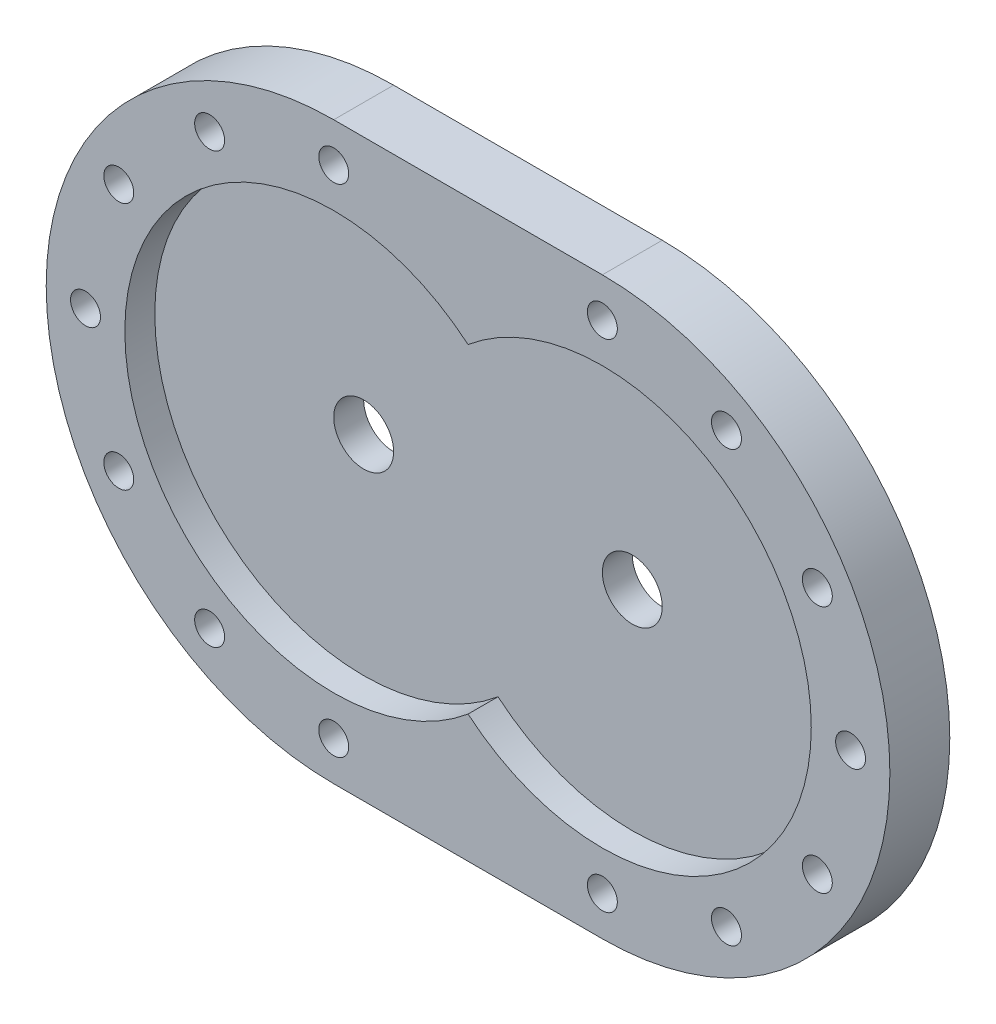
ISO-10303-21;
HEADER;
FILE_DESCRIPTION(('STEP AP214'),'2;1');
FILE_NAME('part.step','',(''),(''),'','','');
FILE_SCHEMA(('AUTOMOTIVE_DESIGN { 1 0 10303 214 1 1 1 1 }'));
ENDSEC;
DATA;
#1=APPLICATION_CONTEXT('core data for automotive mechanical design processes');
#2=APPLICATION_PROTOCOL_DEFINITION('international standard','automotive_design',2000,#1);
#3=PRODUCT_CONTEXT('',#1,'mechanical');
#4=PRODUCT('Part','Part','',(#3));
#5=PRODUCT_RELATED_PRODUCT_CATEGORY('part','',(#4));
#6=PRODUCT_DEFINITION_FORMATION('','',#4);
#7=PRODUCT_DEFINITION_CONTEXT('part definition',#1,'design');
#8=PRODUCT_DEFINITION('design','',#6,#7);
#9=PRODUCT_DEFINITION_SHAPE('','',#8);
#10=(LENGTH_UNIT() NAMED_UNIT(*) SI_UNIT(.MILLI.,.METRE.));
#11=(NAMED_UNIT(*) PLANE_ANGLE_UNIT() SI_UNIT($,.RADIAN.));
#12=(NAMED_UNIT(*) SI_UNIT($,.STERADIAN.) SOLID_ANGLE_UNIT());
#13=UNCERTAINTY_MEASURE_WITH_UNIT(LENGTH_MEASURE(1.E-05),#10,'distance_accuracy_value','');
#14=(GEOMETRIC_REPRESENTATION_CONTEXT(3) GLOBAL_UNCERTAINTY_ASSIGNED_CONTEXT((#13)) GLOBAL_UNIT_ASSIGNED_CONTEXT((#10,
#11,#12)) REPRESENTATION_CONTEXT('',''));
#15=CARTESIAN_POINT('',(0.,0.,0.));
#16=DIRECTION('',(0.,0.,1.));
#17=DIRECTION('',(1.,0.,0.));
#18=AXIS2_PLACEMENT_3D('',#15,#16,#17);
#19=CARTESIAN_POINT('',(-44.845,0.,20.));
#20=DIRECTION('',(0.,0.,-1.));
#21=DIRECTION('',(-1.,0.,0.));
#22=AXIS2_PLACEMENT_3D('',#19,#20,#21);
#23=CYLINDRICAL_SURFACE('',#22,96.);
#24=DIRECTION('',(0.,0.,-1.));
#25=VECTOR('',#24,1.);
#26=CARTESIAN_POINT('',(-44.844999999999,-96.,20.));
#27=LINE('',#26,#25);
#28=CARTESIAN_POINT('',(-44.845,-96.,20.));
#29=VERTEX_POINT('',#28);
#30=CARTESIAN_POINT('',(-44.845,-96.,0.));
#31=VERTEX_POINT('',#30);
#32=EDGE_CURVE('E63',#29,#31,#27,.T.);
#33=ORIENTED_EDGE('',*,*,#32,.F.);
#34=CARTESIAN_POINT('',(-44.845,0.,20.));
#35=DIRECTION('',(0.,0.,1.));
#36=DIRECTION('',(1.,0.,0.));
#37=AXIS2_PLACEMENT_3D('',#34,#35,#36);
#38=CIRCLE('',#37,96.);
#39=CARTESIAN_POINT('',(-44.8450000000003,96.,20.));
#40=VERTEX_POINT('',#39);
#41=EDGE_CURVE('E115',#40,#29,#38,.T.);
#42=ORIENTED_EDGE('',*,*,#41,.F.);
#43=DIRECTION('',(0.,0.,-1.));
#44=VECTOR('',#43,1.);
#45=CARTESIAN_POINT('',(-44.8450000000003,96.,20.));
#46=LINE('',#45,#44);
#47=CARTESIAN_POINT('',(-44.8450000000003,96.,0.));
#48=VERTEX_POINT('',#47);
#49=EDGE_CURVE('E114',#40,#48,#46,.T.);
#50=ORIENTED_EDGE('',*,*,#49,.T.);
#51=CARTESIAN_POINT('',(-44.845,0.,0.));
#52=DIRECTION('',(0.,0.,1.));
#53=DIRECTION('',(1.,0.,0.));
#54=AXIS2_PLACEMENT_3D('',#51,#52,#53);
#55=CIRCLE('',#54,96.);
#56=EDGE_CURVE('E100',#48,#31,#55,.T.);
#57=ORIENTED_EDGE('',*,*,#56,.T.);
#58=EDGE_LOOP('',(#33,#42,#50,#57));
#59=FACE_BOUND('',#58,.T.);
#60=ADVANCED_FACE('F47',(#59),#23,.T.);
#61=CARTESIAN_POINT('',(44.845,0.,20.));
#62=DIRECTION('',(0.,0.,-1.));
#63=DIRECTION('',(-1.,0.,0.));
#64=AXIS2_PLACEMENT_3D('',#61,#62,#63);
#65=CYLINDRICAL_SURFACE('',#64,96.);
#66=CARTESIAN_POINT('',(44.845,0.,20.));
#67=DIRECTION('',(0.,0.,1.));
#68=DIRECTION('',(1.,0.,0.));
#69=AXIS2_PLACEMENT_3D('',#66,#67,#68);
#70=CIRCLE('',#69,96.);
#71=CARTESIAN_POINT('',(44.845,-96.,20.));
#72=VERTEX_POINT('',#71);
#73=CARTESIAN_POINT('',(44.845,96.,20.));
#74=VERTEX_POINT('',#73);
#75=EDGE_CURVE('E71',#72,#74,#70,.T.);
#76=ORIENTED_EDGE('',*,*,#75,.F.);
#77=DIRECTION('',(0.,0.,-1.));
#78=VECTOR('',#77,1.);
#79=CARTESIAN_POINT('',(44.845000000001,-96.,20.));
#80=LINE('',#79,#78);
#81=CARTESIAN_POINT('',(44.845,-96.,0.));
#82=VERTEX_POINT('',#81);
#83=EDGE_CURVE('E130',#72,#82,#80,.T.);
#84=ORIENTED_EDGE('',*,*,#83,.T.);
#85=CARTESIAN_POINT('',(44.845,0.,0.));
#86=DIRECTION('',(0.,0.,1.));
#87=DIRECTION('',(1.,0.,0.));
#88=AXIS2_PLACEMENT_3D('',#85,#86,#87);
#89=CIRCLE('',#88,96.);
#90=CARTESIAN_POINT('',(44.845,96.,0.));
#91=VERTEX_POINT('',#90);
#92=EDGE_CURVE('E111',#82,#91,#89,.T.);
#93=ORIENTED_EDGE('',*,*,#92,.T.);
#94=DIRECTION('',(0.,0.,-1.));
#95=VECTOR('',#94,1.);
#96=CARTESIAN_POINT('',(44.8449999999997,96.,20.));
#97=LINE('',#96,#95);
#98=EDGE_CURVE('E120',#74,#91,#97,.T.);
#99=ORIENTED_EDGE('',*,*,#98,.F.);
#100=EDGE_LOOP('',(#76,#84,#93,#99));
#101=FACE_BOUND('',#100,.T.);
#102=ADVANCED_FACE('F341',(#101),#65,.T.);
#103=CARTESIAN_POINT('',(44.845,0.,20.));
#104=DIRECTION('',(0.,0.,-1.));
#105=DIRECTION('',(-1.,0.,0.));
#106=AXIS2_PLACEMENT_3D('',#103,#104,#105);
#107=CYLINDRICAL_SURFACE('',#106,69.75);
#108=CARTESIAN_POINT('',(44.845,0.,10.));
#109=DIRECTION('',(0.,0.,1.));
#110=DIRECTION('',(1.,0.,0.));
#111=AXIS2_PLACEMENT_3D('',#108,#109,#110);
#112=CIRCLE('',#111,69.75);
#113=CARTESIAN_POINT('',(0.,-53.4227336908175,10.));
#114=VERTEX_POINT('',#113);
#115=CARTESIAN_POINT('',(0.,53.4227336908174,10.));
#116=VERTEX_POINT('',#115);
#117=EDGE_CURVE('E149',#114,#116,#112,.T.);
#118=ORIENTED_EDGE('',*,*,#117,.F.);
#119=DIRECTION('',(0.,0.,-1.));
#120=VECTOR('',#119,1.);
#121=CARTESIAN_POINT('',(0.,-53.4227336908175,20.));
#122=LINE('',#121,#120);
#123=CARTESIAN_POINT('',(0.,-53.4227336908175,20.));
#124=VERTEX_POINT('',#123);
#125=EDGE_CURVE('E11',#124,#114,#122,.T.);
#126=ORIENTED_EDGE('',*,*,#125,.F.);
#127=CARTESIAN_POINT('',(44.845,0.,20.));
#128=DIRECTION('',(0.,0.,1.));
#129=DIRECTION('',(1.,0.,0.));
#130=AXIS2_PLACEMENT_3D('',#127,#128,#129);
#131=CIRCLE('',#130,69.75);
#132=CARTESIAN_POINT('',(0.,53.4227336908174,20.));
#133=VERTEX_POINT('',#132);
#134=EDGE_CURVE('E189',#124,#133,#131,.T.);
#135=ORIENTED_EDGE('',*,*,#134,.T.);
#136=DIRECTION('',(0.,0.,-1.));
#137=VECTOR('',#136,1.);
#138=CARTESIAN_POINT('',(0.,53.4227336908174,20.));
#139=LINE('',#138,#137);
#140=EDGE_CURVE('E56',#133,#116,#139,.T.);
#141=ORIENTED_EDGE('',*,*,#140,.T.);
#142=EDGE_LOOP('',(#118,#126,#135,#141));
#143=FACE_BOUND('',#142,.T.);
#144=ADVANCED_FACE('F287',(#143),#107,.F.);
#145=CARTESIAN_POINT('',(-116.616855338635,41.4375000000001,20.));
#146=DIRECTION('',(0.,0.,-1.));
#147=DIRECTION('',(-1.,0.,0.));
#148=AXIS2_PLACEMENT_3D('',#145,#146,#147);
#149=CYLINDRICAL_SURFACE('',#148,5.);
#150=CARTESIAN_POINT('',(-116.616855338635,41.4375000000001,20.));
#151=DIRECTION('',(0.,0.,1.));
#152=DIRECTION('',(1.,0.,0.));
#153=AXIS2_PLACEMENT_3D('',#150,#151,#152);
#154=CIRCLE('',#153,5.);
#155=CARTESIAN_POINT('',(-111.616855338635,41.4375000000001,20.));
#156=VERTEX_POINT('',#155);
#157=EDGE_CURVE('E221',#156,#156,#154,.F.);
#158=ORIENTED_EDGE('',*,*,#157,.F.);
#159=EDGE_LOOP('',(#158));
#160=FACE_BOUND('',#159,.T.);
#161=CARTESIAN_POINT('',(-116.616855338635,41.4375000000001,0.));
#162=DIRECTION('',(0.,0.,1.));
#163=DIRECTION('',(1.,0.,0.));
#164=AXIS2_PLACEMENT_3D('',#161,#162,#163);
#165=CIRCLE('',#164,5.);
#166=CARTESIAN_POINT('',(-111.616855338635,41.4375000000001,0.));
#167=VERTEX_POINT('',#166);
#168=EDGE_CURVE('E277',#167,#167,#165,.F.);
#169=ORIENTED_EDGE('',*,*,#168,.T.);
#170=EDGE_LOOP('',(#169));
#171=FACE_BOUND('',#170,.T.);
#172=ADVANCED_FACE('F399',(#160,#171),#149,.F.);
#173=CARTESIAN_POINT('',(116.616855338635,-41.4375000000001,20.));
#174=DIRECTION('',(0.,0.,-1.));
#175=DIRECTION('',(-1.,0.,0.));
#176=AXIS2_PLACEMENT_3D('',#173,#174,#175);
#177=CYLINDRICAL_SURFACE('',#176,5.);
#178=CARTESIAN_POINT('',(116.616855338635,-41.4375000000001,20.));
#179=DIRECTION('',(0.,0.,1.));
#180=DIRECTION('',(1.,0.,0.));
#181=AXIS2_PLACEMENT_3D('',#178,#179,#180);
#182=CIRCLE('',#181,5.);
#183=CARTESIAN_POINT('',(121.616855338635,-41.4375000000001,20.));
#184=VERTEX_POINT('',#183);
#185=EDGE_CURVE('E217',#184,#184,#182,.F.);
#186=ORIENTED_EDGE('',*,*,#185,.F.);
#187=EDGE_LOOP('',(#186));
#188=FACE_BOUND('',#187,.T.);
#189=CARTESIAN_POINT('',(116.616855338635,-41.4375000000001,0.));
#190=DIRECTION('',(0.,0.,1.));
#191=DIRECTION('',(1.,0.,0.));
#192=AXIS2_PLACEMENT_3D('',#189,#190,#191);
#193=CIRCLE('',#192,5.);
#194=CARTESIAN_POINT('',(121.616855338635,-41.4375000000001,0.));
#195=VERTEX_POINT('',#194);
#196=EDGE_CURVE('E273',#195,#195,#193,.F.);
#197=ORIENTED_EDGE('',*,*,#196,.T.);
#198=EDGE_LOOP('',(#197));
#199=FACE_BOUND('',#198,.T.);
#200=ADVANCED_FACE('F401',(#188,#199),#177,.F.);
#201=CARTESIAN_POINT('',(44.8449999999997,-82.875,20.));
#202=DIRECTION('',(0.,0.,-1.));
#203=DIRECTION('',(-1.,0.,0.));
#204=AXIS2_PLACEMENT_3D('',#201,#202,#203);
#205=CYLINDRICAL_SURFACE('',#204,5.);
#206=CARTESIAN_POINT('',(44.8449999999997,-82.875,20.));
#207=DIRECTION('',(0.,0.,1.));
#208=DIRECTION('',(1.,0.,0.));
#209=AXIS2_PLACEMENT_3D('',#206,#207,#208);
#210=CIRCLE('',#209,5.);
#211=CARTESIAN_POINT('',(49.8449999999997,-82.875,20.));
#212=VERTEX_POINT('',#211);
#213=EDGE_CURVE('E213',#212,#212,#210,.F.);
#214=ORIENTED_EDGE('',*,*,#213,.F.);
#215=EDGE_LOOP('',(#214));
#216=FACE_BOUND('',#215,.T.);
#217=CARTESIAN_POINT('',(44.8449999999997,-82.875,0.));
#218=DIRECTION('',(0.,0.,1.));
#219=DIRECTION('',(1.,0.,0.));
#220=AXIS2_PLACEMENT_3D('',#217,#218,#219);
#221=CIRCLE('',#220,5.);
#222=CARTESIAN_POINT('',(49.8449999999997,-82.875,0.));
#223=VERTEX_POINT('',#222);
#224=EDGE_CURVE('E269',#223,#223,#221,.F.);
#225=ORIENTED_EDGE('',*,*,#224,.T.);
#226=EDGE_LOOP('',(#225));
#227=FACE_BOUND('',#226,.T.);
#228=ADVANCED_FACE('F408',(#216,#227),#205,.F.);
#229=CARTESIAN_POINT('',(44.8449999999997,82.875,20.));
#230=DIRECTION('',(0.,0.,-1.));
#231=DIRECTION('',(-1.,0.,0.));
#232=AXIS2_PLACEMENT_3D('',#229,#230,#231);
#233=CYLINDRICAL_SURFACE('',#232,5.);
#234=CARTESIAN_POINT('',(44.8449999999997,82.875,20.));
#235=DIRECTION('',(0.,0.,1.));
#236=DIRECTION('',(1.,0.,0.));
#237=AXIS2_PLACEMENT_3D('',#234,#235,#236);
#238=CIRCLE('',#237,5.);
#239=CARTESIAN_POINT('',(49.8449999999997,82.875,20.));
#240=VERTEX_POINT('',#239);
#241=EDGE_CURVE('E209',#240,#240,#238,.T.);
#242=ORIENTED_EDGE('',*,*,#241,.T.);
#243=EDGE_LOOP('',(#242));
#244=FACE_BOUND('',#243,.T.);
#245=CARTESIAN_POINT('',(44.8449999999997,82.875,0.));
#246=DIRECTION('',(0.,0.,1.));
#247=DIRECTION('',(1.,0.,0.));
#248=AXIS2_PLACEMENT_3D('',#245,#246,#247);
#249=CIRCLE('',#248,5.);
#250=CARTESIAN_POINT('',(49.8449999999997,82.875,0.));
#251=VERTEX_POINT('',#250);
#252=EDGE_CURVE('E265',#251,#251,#249,.T.);
#253=ORIENTED_EDGE('',*,*,#252,.F.);
#254=EDGE_LOOP('',(#253));
#255=FACE_BOUND('',#254,.T.);
#256=ADVANCED_FACE('F414',(#244,#255),#233,.F.);
#257=CARTESIAN_POINT('',(86.2824999999998,71.7718553386354,20.));
#258=DIRECTION('',(0.,0.,-1.));
#259=DIRECTION('',(-1.,0.,0.));
#260=AXIS2_PLACEMENT_3D('',#257,#258,#259);
#261=CYLINDRICAL_SURFACE('',#260,5.00000000000001);
#262=CARTESIAN_POINT('',(86.2824999999998,71.7718553386354,20.));
#263=DIRECTION('',(0.,0.,1.));
#264=DIRECTION('',(1.,0.,0.));
#265=AXIS2_PLACEMENT_3D('',#262,#263,#264);
#266=CIRCLE('',#265,5.00000000000001);
#267=CARTESIAN_POINT('',(91.2824999999999,71.7718553386354,20.));
#268=VERTEX_POINT('',#267);
#269=EDGE_CURVE('E205',#268,#268,#266,.T.);
#270=ORIENTED_EDGE('',*,*,#269,.T.);
#271=EDGE_LOOP('',(#270));
#272=FACE_BOUND('',#271,.T.);
#273=CARTESIAN_POINT('',(86.2824999999998,71.7718553386354,0.));
#274=DIRECTION('',(0.,0.,1.));
#275=DIRECTION('',(1.,0.,0.));
#276=AXIS2_PLACEMENT_3D('',#273,#274,#275);
#277=CIRCLE('',#276,5.00000000000001);
#278=CARTESIAN_POINT('',(91.2824999999999,71.7718553386354,0.));
#279=VERTEX_POINT('',#278);
#280=EDGE_CURVE('E261',#279,#279,#277,.T.);
#281=ORIENTED_EDGE('',*,*,#280,.F.);
#282=EDGE_LOOP('',(#281));
#283=FACE_BOUND('',#282,.T.);
#284=ADVANCED_FACE('F418',(#272,#283),#261,.F.);
#285=CARTESIAN_POINT('',(116.616855338635,41.4375000000001,20.));
#286=DIRECTION('',(0.,0.,-1.));
#287=DIRECTION('',(-1.,0.,0.));
#288=AXIS2_PLACEMENT_3D('',#285,#286,#287);
#289=CYLINDRICAL_SURFACE('',#288,5.);
#290=CARTESIAN_POINT('',(116.616855338635,41.4375000000001,20.));
#291=DIRECTION('',(0.,0.,1.));
#292=DIRECTION('',(1.,0.,0.));
#293=AXIS2_PLACEMENT_3D('',#290,#291,#292);
#294=CIRCLE('',#293,5.);
#295=CARTESIAN_POINT('',(121.616855338635,41.4375000000001,20.));
#296=VERTEX_POINT('',#295);
#297=EDGE_CURVE('E201',#296,#296,#294,.T.);
#298=ORIENTED_EDGE('',*,*,#297,.T.);
#299=EDGE_LOOP('',(#298));
#300=FACE_BOUND('',#299,.T.);
#301=CARTESIAN_POINT('',(116.616855338635,41.4375000000001,0.));
#302=DIRECTION('',(0.,0.,1.));
#303=DIRECTION('',(1.,0.,0.));
#304=AXIS2_PLACEMENT_3D('',#301,#302,#303);
#305=CIRCLE('',#304,5.);
#306=CARTESIAN_POINT('',(121.616855338635,41.4375000000001,0.));
#307=VERTEX_POINT('',#306);
#308=EDGE_CURVE('E257',#307,#307,#305,.T.);
#309=ORIENTED_EDGE('',*,*,#308,.F.);
#310=EDGE_LOOP('',(#309));
#311=FACE_BOUND('',#310,.T.);
#312=ADVANCED_FACE('F422',(#300,#311),#289,.F.);
#313=CARTESIAN_POINT('',(127.72,0.,20.));
#314=DIRECTION('',(0.,0.,-1.));
#315=DIRECTION('',(-1.,0.,0.));
#316=AXIS2_PLACEMENT_3D('',#313,#314,#315);
#317=CYLINDRICAL_SURFACE('',#316,4.99999999999999);
#318=CARTESIAN_POINT('',(127.72,0.,20.));
#319=DIRECTION('',(0.,0.,1.));
#320=DIRECTION('',(1.,0.,0.));
#321=AXIS2_PLACEMENT_3D('',#318,#319,#320);
#322=CIRCLE('',#321,4.99999999999999);
#323=CARTESIAN_POINT('',(132.72,0.,20.));
#324=VERTEX_POINT('',#323);
#325=EDGE_CURVE('E197',#324,#324,#322,.T.);
#326=ORIENTED_EDGE('',*,*,#325,.T.);
#327=EDGE_LOOP('',(#326));
#328=FACE_BOUND('',#327,.T.);
#329=CARTESIAN_POINT('',(127.72,0.,0.));
#330=DIRECTION('',(0.,0.,1.));
#331=DIRECTION('',(1.,0.,0.));
#332=AXIS2_PLACEMENT_3D('',#329,#330,#331);
#333=CIRCLE('',#332,4.99999999999999);
#334=CARTESIAN_POINT('',(132.72,0.,0.));
#335=VERTEX_POINT('',#334);
#336=EDGE_CURVE('E110',#335,#335,#333,.T.);
#337=ORIENTED_EDGE('',*,*,#336,.F.);
#338=EDGE_LOOP('',(#337));
#339=FACE_BOUND('',#338,.T.);
#340=ADVANCED_FACE('F426',(#328,#339),#317,.F.);
#341=CARTESIAN_POINT('',(-44.845,0.,20.));
#342=DIRECTION('',(0.,0.,-1.));
#343=DIRECTION('',(-1.,0.,0.));
#344=AXIS2_PLACEMENT_3D('',#341,#342,#343);
#345=CYLINDRICAL_SURFACE('',#344,69.75);
#346=CARTESIAN_POINT('',(-44.845,0.,10.));
#347=DIRECTION('',(0.,0.,1.));
#348=DIRECTION('',(1.,0.,0.));
#349=AXIS2_PLACEMENT_3D('',#346,#347,#348);
#350=CIRCLE('',#349,69.75);
#351=EDGE_CURVE('E145',#116,#114,#350,.T.);
#352=ORIENTED_EDGE('',*,*,#351,.F.);
#353=ORIENTED_EDGE('',*,*,#140,.F.);
#354=CARTESIAN_POINT('',(-44.845,0.,20.));
#355=DIRECTION('',(0.,0.,1.));
#356=DIRECTION('',(1.,0.,0.));
#357=AXIS2_PLACEMENT_3D('',#354,#355,#356);
#358=CIRCLE('',#357,69.75);
#359=EDGE_CURVE('E193',#133,#124,#358,.T.);
#360=ORIENTED_EDGE('',*,*,#359,.T.);
#361=ORIENTED_EDGE('',*,*,#125,.T.);
#362=EDGE_LOOP('',(#352,#353,#360,#361));
#363=FACE_BOUND('',#362,.T.);
#364=ADVANCED_FACE('F293',(#363),#345,.F.);
#365=CARTESIAN_POINT('',(86.2824999999998,-71.7718553386354,20.));
#366=DIRECTION('',(0.,0.,-1.));
#367=DIRECTION('',(-1.,0.,0.));
#368=AXIS2_PLACEMENT_3D('',#365,#366,#367);
#369=CYLINDRICAL_SURFACE('',#368,5.00000000000001);
#370=CARTESIAN_POINT('',(86.2824999999998,-71.7718553386354,20.));
#371=DIRECTION('',(0.,0.,1.));
#372=DIRECTION('',(1.,0.,0.));
#373=AXIS2_PLACEMENT_3D('',#370,#371,#372);
#374=CIRCLE('',#373,5.00000000000001);
#375=CARTESIAN_POINT('',(91.2824999999999,-71.7718553386354,20.));
#376=VERTEX_POINT('',#375);
#377=EDGE_CURVE('E181',#376,#376,#374,.F.);
#378=ORIENTED_EDGE('',*,*,#377,.F.);
#379=EDGE_LOOP('',(#378));
#380=FACE_BOUND('',#379,.T.);
#381=CARTESIAN_POINT('',(86.2824999999998,-71.7718553386354,0.));
#382=DIRECTION('',(0.,0.,1.));
#383=DIRECTION('',(1.,0.,0.));
#384=AXIS2_PLACEMENT_3D('',#381,#382,#383);
#385=CIRCLE('',#384,5.00000000000001);
#386=CARTESIAN_POINT('',(91.2824999999999,-71.7718553386354,0.));
#387=VERTEX_POINT('',#386);
#388=EDGE_CURVE('E248',#387,#387,#385,.F.);
#389=ORIENTED_EDGE('',*,*,#388,.T.);
#390=EDGE_LOOP('',(#389));
#391=FACE_BOUND('',#390,.T.);
#392=ADVANCED_FACE('F350',(#380,#391),#369,.F.);
#393=CARTESIAN_POINT('',(-44.8449999999997,-82.875,20.));
#394=DIRECTION('',(0.,0.,-1.));
#395=DIRECTION('',(-1.,0.,0.));
#396=AXIS2_PLACEMENT_3D('',#393,#394,#395);
#397=CYLINDRICAL_SURFACE('',#396,5.);
#398=CARTESIAN_POINT('',(-44.8449999999997,-82.875,20.));
#399=DIRECTION('',(0.,0.,1.));
#400=DIRECTION('',(1.,0.,0.));
#401=AXIS2_PLACEMENT_3D('',#398,#399,#400);
#402=CIRCLE('',#401,5.);
#403=CARTESIAN_POINT('',(-39.8449999999997,-82.875,20.));
#404=VERTEX_POINT('',#403);
#405=EDGE_CURVE('E177',#404,#404,#402,.T.);
#406=ORIENTED_EDGE('',*,*,#405,.T.);
#407=EDGE_LOOP('',(#406));
#408=FACE_BOUND('',#407,.T.);
#409=CARTESIAN_POINT('',(-44.8449999999997,-82.875,0.));
#410=DIRECTION('',(0.,0.,1.));
#411=DIRECTION('',(1.,0.,0.));
#412=AXIS2_PLACEMENT_3D('',#409,#410,#411);
#413=CIRCLE('',#412,5.);
#414=CARTESIAN_POINT('',(-39.8449999999997,-82.875,0.));
#415=VERTEX_POINT('',#414);
#416=EDGE_CURVE('E244',#415,#415,#413,.T.);
#417=ORIENTED_EDGE('',*,*,#416,.F.);
#418=EDGE_LOOP('',(#417));
#419=FACE_BOUND('',#418,.T.);
#420=ADVANCED_FACE('F353',(#408,#419),#397,.F.);
#421=CARTESIAN_POINT('',(-86.2824999999998,-71.7718553386354,20.));
#422=DIRECTION('',(0.,0.,-1.));
#423=DIRECTION('',(-1.,0.,0.));
#424=AXIS2_PLACEMENT_3D('',#421,#422,#423);
#425=CYLINDRICAL_SURFACE('',#424,5.00000000000001);
#426=CARTESIAN_POINT('',(-86.2824999999998,-71.7718553386354,20.));
#427=DIRECTION('',(0.,0.,1.));
#428=DIRECTION('',(1.,0.,0.));
#429=AXIS2_PLACEMENT_3D('',#426,#427,#428);
#430=CIRCLE('',#429,5.00000000000001);
#431=CARTESIAN_POINT('',(-81.2824999999998,-71.7718553386354,20.));
#432=VERTEX_POINT('',#431);
#433=EDGE_CURVE('E173',#432,#432,#430,.T.);
#434=ORIENTED_EDGE('',*,*,#433,.T.);
#435=EDGE_LOOP('',(#434));
#436=FACE_BOUND('',#435,.T.);
#437=CARTESIAN_POINT('',(-86.2824999999998,-71.7718553386354,0.));
#438=DIRECTION('',(0.,0.,1.));
#439=DIRECTION('',(1.,0.,0.));
#440=AXIS2_PLACEMENT_3D('',#437,#438,#439);
#441=CIRCLE('',#440,5.00000000000001);
#442=CARTESIAN_POINT('',(-81.2824999999998,-71.7718553386354,0.));
#443=VERTEX_POINT('',#442);
#444=EDGE_CURVE('E240',#443,#443,#441,.T.);
#445=ORIENTED_EDGE('',*,*,#444,.F.);
#446=EDGE_LOOP('',(#445));
#447=FACE_BOUND('',#446,.T.);
#448=ADVANCED_FACE('F357',(#436,#447),#425,.F.);
#449=CARTESIAN_POINT('',(-116.616855338635,-41.4375000000001,20.));
#450=DIRECTION('',(0.,0.,-1.));
#451=DIRECTION('',(-1.,0.,0.));
#452=AXIS2_PLACEMENT_3D('',#449,#450,#451);
#453=CYLINDRICAL_SURFACE('',#452,5.);
#454=CARTESIAN_POINT('',(-116.616855338635,-41.4375000000001,20.));
#455=DIRECTION('',(0.,0.,1.));
#456=DIRECTION('',(1.,0.,0.));
#457=AXIS2_PLACEMENT_3D('',#454,#455,#456);
#458=CIRCLE('',#457,5.);
#459=CARTESIAN_POINT('',(-111.616855338635,-41.4375000000001,20.));
#460=VERTEX_POINT('',#459);
#461=EDGE_CURVE('E169',#460,#460,#458,.T.);
#462=ORIENTED_EDGE('',*,*,#461,.T.);
#463=EDGE_LOOP('',(#462));
#464=FACE_BOUND('',#463,.T.);
#465=CARTESIAN_POINT('',(-116.616855338635,-41.4375000000001,0.));
#466=DIRECTION('',(0.,0.,1.));
#467=DIRECTION('',(1.,0.,0.));
#468=AXIS2_PLACEMENT_3D('',#465,#466,#467);
#469=CIRCLE('',#468,5.);
#470=CARTESIAN_POINT('',(-111.616855338635,-41.4375000000001,0.));
#471=VERTEX_POINT('',#470);
#472=EDGE_CURVE('E236',#471,#471,#469,.T.);
#473=ORIENTED_EDGE('',*,*,#472,.F.);
#474=EDGE_LOOP('',(#473));
#475=FACE_BOUND('',#474,.T.);
#476=ADVANCED_FACE('F361',(#464,#475),#453,.F.);
#477=CARTESIAN_POINT('',(-127.72,0.,20.));
#478=DIRECTION('',(0.,0.,-1.));
#479=DIRECTION('',(-1.,0.,0.));
#480=AXIS2_PLACEMENT_3D('',#477,#478,#479);
#481=CYLINDRICAL_SURFACE('',#480,4.99999999999999);
#482=CARTESIAN_POINT('',(-127.72,0.,20.));
#483=DIRECTION('',(0.,0.,1.));
#484=DIRECTION('',(1.,0.,0.));
#485=AXIS2_PLACEMENT_3D('',#482,#483,#484);
#486=CIRCLE('',#485,4.99999999999999);
#487=CARTESIAN_POINT('',(-122.72,0.,20.));
#488=VERTEX_POINT('',#487);
#489=EDGE_CURVE('E164',#488,#488,#486,.F.);
#490=ORIENTED_EDGE('',*,*,#489,.F.);
#491=EDGE_LOOP('',(#490));
#492=FACE_BOUND('',#491,.T.);
#493=CARTESIAN_POINT('',(-127.72,0.,0.));
#494=DIRECTION('',(0.,0.,1.));
#495=DIRECTION('',(1.,0.,0.));
#496=AXIS2_PLACEMENT_3D('',#493,#494,#495);
#497=CIRCLE('',#496,4.99999999999999);
#498=CARTESIAN_POINT('',(-122.72,0.,0.));
#499=VERTEX_POINT('',#498);
#500=EDGE_CURVE('E232',#499,#499,#497,.F.);
#501=ORIENTED_EDGE('',*,*,#500,.T.);
#502=EDGE_LOOP('',(#501));
#503=FACE_BOUND('',#502,.T.);
#504=ADVANCED_FACE('F364',(#492,#503),#481,.F.);
#505=CARTESIAN_POINT('',(-86.2824999999998,71.7718553386354,20.));
#506=DIRECTION('',(0.,0.,-1.));
#507=DIRECTION('',(-1.,0.,0.));
#508=AXIS2_PLACEMENT_3D('',#505,#506,#507);
#509=CYLINDRICAL_SURFACE('',#508,5.00000000000001);
#510=CARTESIAN_POINT('',(-86.2824999999998,71.7718553386354,20.));
#511=DIRECTION('',(0.,0.,1.));
#512=DIRECTION('',(1.,0.,0.));
#513=AXIS2_PLACEMENT_3D('',#510,#511,#512);
#514=CIRCLE('',#513,5.00000000000001);
#515=CARTESIAN_POINT('',(-81.2824999999998,71.7718553386354,20.));
#516=VERTEX_POINT('',#515);
#517=EDGE_CURVE('E160',#516,#516,#514,.F.);
#518=ORIENTED_EDGE('',*,*,#517,.F.);
#519=EDGE_LOOP('',(#518));
#520=FACE_BOUND('',#519,.T.);
#521=CARTESIAN_POINT('',(-86.2824999999998,71.7718553386354,0.));
#522=DIRECTION('',(0.,0.,1.));
#523=DIRECTION('',(1.,0.,0.));
#524=AXIS2_PLACEMENT_3D('',#521,#522,#523);
#525=CIRCLE('',#524,5.00000000000001);
#526=CARTESIAN_POINT('',(-81.2824999999998,71.7718553386354,0.));
#527=VERTEX_POINT('',#526);
#528=EDGE_CURVE('E153',#527,#527,#525,.F.);
#529=ORIENTED_EDGE('',*,*,#528,.T.);
#530=EDGE_LOOP('',(#529));
#531=FACE_BOUND('',#530,.T.);
#532=ADVANCED_FACE('F49',(#520,#531),#509,.F.);
#533=CARTESIAN_POINT('',(-44.8449999999997,82.875,20.));
#534=DIRECTION('',(0.,0.,-1.));
#535=DIRECTION('',(-1.,0.,0.));
#536=AXIS2_PLACEMENT_3D('',#533,#534,#535);
#537=CYLINDRICAL_SURFACE('',#536,5.);
#538=CARTESIAN_POINT('',(-44.8449999999997,82.875,20.));
#539=DIRECTION('',(0.,0.,1.));
#540=DIRECTION('',(1.,0.,0.));
#541=AXIS2_PLACEMENT_3D('',#538,#539,#540);
#542=CIRCLE('',#541,5.);
#543=CARTESIAN_POINT('',(-39.8449999999997,82.875,20.));
#544=VERTEX_POINT('',#543);
#545=EDGE_CURVE('E225',#544,#544,#542,.F.);
#546=ORIENTED_EDGE('',*,*,#545,.F.);
#547=EDGE_LOOP('',(#546));
#548=FACE_BOUND('',#547,.T.);
#549=CARTESIAN_POINT('',(-44.8449999999997,82.875,0.));
#550=DIRECTION('',(0.,0.,1.));
#551=DIRECTION('',(1.,0.,0.));
#552=AXIS2_PLACEMENT_3D('',#549,#550,#551);
#553=CIRCLE('',#552,5.);
#554=CARTESIAN_POINT('',(-39.8449999999997,82.875,0.));
#555=VERTEX_POINT('',#554);
#556=EDGE_CURVE('E165',#555,#555,#553,.F.);
#557=ORIENTED_EDGE('',*,*,#556,.T.);
#558=EDGE_LOOP('',(#557));
#559=FACE_BOUND('',#558,.T.);
#560=ADVANCED_FACE('F298',(#548,#559),#537,.F.);
#561=CARTESIAN_POINT('',(0.,0.,20.));
#562=DIRECTION('',(0.,0.,1.));
#563=DIRECTION('',(1.,0.,0.));
#564=AXIS2_PLACEMENT_3D('',#561,#562,#563);
#565=PLANE('',#564);
#566=DIRECTION('',(1.,0.,0.));
#567=VECTOR('',#566,1.);
#568=CARTESIAN_POINT('',(0.,-96.,20.));
#569=LINE('',#568,#567);
#570=EDGE_CURVE('E653',#29,#72,#569,.T.);
#571=ORIENTED_EDGE('',*,*,#570,.T.);
#572=ORIENTED_EDGE('',*,*,#75,.T.);
#573=DIRECTION('',(1.,0.,0.));
#574=VECTOR('',#573,1.);
#575=CARTESIAN_POINT('',(0.,96.,20.));
#576=LINE('',#575,#574);
#577=EDGE_CURVE('E121',#40,#74,#576,.T.);
#578=ORIENTED_EDGE('',*,*,#577,.F.);
#579=ORIENTED_EDGE('',*,*,#41,.T.);
#580=EDGE_LOOP('',(#571,#572,#578,#579));
#581=FACE_BOUND('',#580,.T.);
#582=ORIENTED_EDGE('',*,*,#517,.T.);
#583=EDGE_LOOP('',(#582));
#584=FACE_BOUND('',#583,.T.);
#585=ORIENTED_EDGE('',*,*,#489,.T.);
#586=EDGE_LOOP('',(#585));
#587=FACE_BOUND('',#586,.T.);
#588=ORIENTED_EDGE('',*,*,#461,.F.);
#589=EDGE_LOOP('',(#588));
#590=FACE_BOUND('',#589,.T.);
#591=ORIENTED_EDGE('',*,*,#433,.F.);
#592=EDGE_LOOP('',(#591));
#593=FACE_BOUND('',#592,.T.);
#594=ORIENTED_EDGE('',*,*,#405,.F.);
#595=EDGE_LOOP('',(#594));
#596=FACE_BOUND('',#595,.T.);
#597=ORIENTED_EDGE('',*,*,#377,.T.);
#598=EDGE_LOOP('',(#597));
#599=FACE_BOUND('',#598,.T.);
#600=ORIENTED_EDGE('',*,*,#134,.F.);
#601=ORIENTED_EDGE('',*,*,#359,.F.);
#602=EDGE_LOOP('',(#600,#601));
#603=FACE_BOUND('',#602,.T.);
#604=ORIENTED_EDGE('',*,*,#325,.F.);
#605=EDGE_LOOP('',(#604));
#606=FACE_BOUND('',#605,.T.);
#607=ORIENTED_EDGE('',*,*,#297,.F.);
#608=EDGE_LOOP('',(#607));
#609=FACE_BOUND('',#608,.T.);
#610=ORIENTED_EDGE('',*,*,#269,.F.);
#611=EDGE_LOOP('',(#610));
#612=FACE_BOUND('',#611,.T.);
#613=ORIENTED_EDGE('',*,*,#241,.F.);
#614=EDGE_LOOP('',(#613));
#615=FACE_BOUND('',#614,.T.);
#616=ORIENTED_EDGE('',*,*,#213,.T.);
#617=EDGE_LOOP('',(#616));
#618=FACE_BOUND('',#617,.T.);
#619=ORIENTED_EDGE('',*,*,#185,.T.);
#620=EDGE_LOOP('',(#619));
#621=FACE_BOUND('',#620,.T.);
#622=ORIENTED_EDGE('',*,*,#157,.T.);
#623=EDGE_LOOP('',(#622));
#624=FACE_BOUND('',#623,.T.);
#625=ORIENTED_EDGE('',*,*,#545,.T.);
#626=EDGE_LOOP('',(#625));
#627=FACE_BOUND('',#626,.T.);
#628=ADVANCED_FACE('F295',(#581,#584,#587,#590,#593,#596,#599,#603,#606,#609,#612,#615,#618,
#621,#624,#627),#565,.T.);
#629=CARTESIAN_POINT('',(0.,0.,0.));
#630=DIRECTION('',(0.,0.,1.));
#631=DIRECTION('',(1.,0.,0.));
#632=AXIS2_PLACEMENT_3D('',#629,#630,#631);
#633=PLANE('',#632);
#634=ORIENTED_EDGE('',*,*,#92,.F.);
#635=DIRECTION('',(1.,0.,0.));
#636=VECTOR('',#635,1.);
#637=CARTESIAN_POINT('',(0.,-96.,0.));
#638=LINE('',#637,#636);
#639=EDGE_CURVE('E108',#31,#82,#638,.T.);
#640=ORIENTED_EDGE('',*,*,#639,.F.);
#641=ORIENTED_EDGE('',*,*,#56,.F.);
#642=DIRECTION('',(1.,0.,0.));
#643=VECTOR('',#642,1.);
#644=CARTESIAN_POINT('',(0.,96.,0.));
#645=LINE('',#644,#643);
#646=EDGE_CURVE('E106',#48,#91,#645,.T.);
#647=ORIENTED_EDGE('',*,*,#646,.T.);
#648=EDGE_LOOP('',(#634,#640,#641,#647));
#649=FACE_BOUND('',#648,.T.);
#650=ORIENTED_EDGE('',*,*,#528,.F.);
#651=EDGE_LOOP('',(#650));
#652=FACE_BOUND('',#651,.T.);
#653=ORIENTED_EDGE('',*,*,#500,.F.);
#654=EDGE_LOOP('',(#653));
#655=FACE_BOUND('',#654,.T.);
#656=ORIENTED_EDGE('',*,*,#472,.T.);
#657=EDGE_LOOP('',(#656));
#658=FACE_BOUND('',#657,.T.);
#659=ORIENTED_EDGE('',*,*,#444,.T.);
#660=EDGE_LOOP('',(#659));
#661=FACE_BOUND('',#660,.T.);
#662=ORIENTED_EDGE('',*,*,#416,.T.);
#663=EDGE_LOOP('',(#662));
#664=FACE_BOUND('',#663,.T.);
#665=ORIENTED_EDGE('',*,*,#388,.F.);
#666=EDGE_LOOP('',(#665));
#667=FACE_BOUND('',#666,.T.);
#668=ORIENTED_EDGE('',*,*,#336,.T.);
#669=EDGE_LOOP('',(#668));
#670=FACE_BOUND('',#669,.T.);
#671=ORIENTED_EDGE('',*,*,#308,.T.);
#672=EDGE_LOOP('',(#671));
#673=FACE_BOUND('',#672,.T.);
#674=ORIENTED_EDGE('',*,*,#280,.T.);
#675=EDGE_LOOP('',(#674));
#676=FACE_BOUND('',#675,.T.);
#677=ORIENTED_EDGE('',*,*,#252,.T.);
#678=EDGE_LOOP('',(#677));
#679=FACE_BOUND('',#678,.T.);
#680=ORIENTED_EDGE('',*,*,#224,.F.);
#681=EDGE_LOOP('',(#680));
#682=FACE_BOUND('',#681,.T.);
#683=ORIENTED_EDGE('',*,*,#196,.F.);
#684=EDGE_LOOP('',(#683));
#685=FACE_BOUND('',#684,.T.);
#686=ORIENTED_EDGE('',*,*,#168,.F.);
#687=EDGE_LOOP('',(#686));
#688=FACE_BOUND('',#687,.T.);
#689=ORIENTED_EDGE('',*,*,#556,.F.);
#690=EDGE_LOOP('',(#689));
#691=FACE_BOUND('',#690,.T.);
#692=CARTESIAN_POINT('',(-44.845,0.,0.));
#693=DIRECTION('',(0.,0.,1.));
#694=DIRECTION('',(1.,0.,0.));
#695=AXIS2_PLACEMENT_3D('',#692,#693,#694);
#696=CIRCLE('',#695,9.99999999999999);
#697=CARTESIAN_POINT('',(-34.845,0.,0.));
#698=VERTEX_POINT('',#697);
#699=EDGE_CURVE('E135',#698,#698,#696,.T.);
#700=ORIENTED_EDGE('',*,*,#699,.T.);
#701=EDGE_LOOP('',(#700));
#702=FACE_BOUND('',#701,.T.);
#703=CARTESIAN_POINT('',(44.845,0.,0.));
#704=DIRECTION('',(0.,0.,1.));
#705=DIRECTION('',(1.,0.,0.));
#706=AXIS2_PLACEMENT_3D('',#703,#704,#705);
#707=CIRCLE('',#706,10.);
#708=CARTESIAN_POINT('',(54.845,0.,0.));
#709=VERTEX_POINT('',#708);
#710=EDGE_CURVE('E141',#709,#709,#707,.T.);
#711=ORIENTED_EDGE('',*,*,#710,.T.);
#712=EDGE_LOOP('',(#711));
#713=FACE_BOUND('',#712,.T.);
#714=ADVANCED_FACE('F103',(#649,#652,#655,#658,#661,#664,#667,#670,#673,#676,#679,#682,#685,
#688,#691,#702,#713),#633,.F.);
#715=CARTESIAN_POINT('',(44.845,0.,10.));
#716=DIRECTION('',(0.,0.,-1.));
#717=DIRECTION('',(-1.,0.,0.));
#718=AXIS2_PLACEMENT_3D('',#715,#716,#717);
#719=CYLINDRICAL_SURFACE('',#718,10.);
#720=CARTESIAN_POINT('',(44.845,0.,10.));
#721=DIRECTION('',(0.,0.,1.));
#722=DIRECTION('',(1.,0.,0.));
#723=AXIS2_PLACEMENT_3D('',#720,#721,#722);
#724=CIRCLE('',#723,10.);
#725=CARTESIAN_POINT('',(54.845,0.,10.));
#726=VERTEX_POINT('',#725);
#727=EDGE_CURVE('E140',#726,#726,#724,.T.);
#728=ORIENTED_EDGE('',*,*,#727,.T.);
#729=EDGE_LOOP('',(#728));
#730=FACE_BOUND('',#729,.T.);
#731=ORIENTED_EDGE('',*,*,#710,.F.);
#732=EDGE_LOOP('',(#731));
#733=FACE_BOUND('',#732,.T.);
#734=ADVANCED_FACE('F324',(#730,#733),#719,.F.);
#735=CARTESIAN_POINT('',(-44.845,0.,10.));
#736=DIRECTION('',(0.,0.,-1.));
#737=DIRECTION('',(-1.,0.,0.));
#738=AXIS2_PLACEMENT_3D('',#735,#736,#737);
#739=CYLINDRICAL_SURFACE('',#738,9.99999999999999);
#740=CARTESIAN_POINT('',(-44.845,0.,10.));
#741=DIRECTION('',(0.,0.,1.));
#742=DIRECTION('',(1.,0.,0.));
#743=AXIS2_PLACEMENT_3D('',#740,#741,#742);
#744=CIRCLE('',#743,9.99999999999999);
#745=CARTESIAN_POINT('',(-34.845,0.,10.));
#746=VERTEX_POINT('',#745);
#747=EDGE_CURVE('E136',#746,#746,#744,.T.);
#748=ORIENTED_EDGE('',*,*,#747,.T.);
#749=EDGE_LOOP('',(#748));
#750=FACE_BOUND('',#749,.T.);
#751=ORIENTED_EDGE('',*,*,#699,.F.);
#752=EDGE_LOOP('',(#751));
#753=FACE_BOUND('',#752,.T.);
#754=ADVANCED_FACE('F331',(#750,#753),#739,.F.);
#755=CARTESIAN_POINT('',(0.,0.,10.));
#756=DIRECTION('',(0.,0.,1.));
#757=DIRECTION('',(1.,0.,0.));
#758=AXIS2_PLACEMENT_3D('',#755,#756,#757);
#759=PLANE('',#758);
#760=ORIENTED_EDGE('',*,*,#747,.F.);
#761=EDGE_LOOP('',(#760));
#762=FACE_BOUND('',#761,.T.);
#763=ORIENTED_EDGE('',*,*,#727,.F.);
#764=EDGE_LOOP('',(#763));
#765=FACE_BOUND('',#764,.T.);
#766=ORIENTED_EDGE('',*,*,#351,.T.);
#767=ORIENTED_EDGE('',*,*,#117,.T.);
#768=EDGE_LOOP('',(#766,#767));
#769=FACE_BOUND('',#768,.T.);
#770=ADVANCED_FACE('F292',(#762,#765,#769),#759,.T.);
#771=CARTESIAN_POINT('',(0.,96.,20.));
#772=DIRECTION('',(0.,1.,0.));
#773=DIRECTION('',(0.,0.,1.));
#774=AXIS2_PLACEMENT_3D('',#771,#772,#773);
#775=PLANE('',#774);
#776=ORIENTED_EDGE('',*,*,#646,.F.);
#777=ORIENTED_EDGE('',*,*,#49,.F.);
#778=ORIENTED_EDGE('',*,*,#577,.T.);
#779=ORIENTED_EDGE('',*,*,#98,.T.);
#780=EDGE_LOOP('',(#776,#777,#778,#779));
#781=FACE_BOUND('',#780,.T.);
#782=ADVANCED_FACE('F124',(#781),#775,.T.);
#783=CARTESIAN_POINT('',(0.,-96.,20.));
#784=DIRECTION('',(0.,1.,0.));
#785=DIRECTION('',(0.,0.,1.));
#786=AXIS2_PLACEMENT_3D('',#783,#784,#785);
#787=PLANE('',#786);
#788=ORIENTED_EDGE('',*,*,#639,.T.);
#789=ORIENTED_EDGE('',*,*,#83,.F.);
#790=ORIENTED_EDGE('',*,*,#570,.F.);
#791=ORIENTED_EDGE('',*,*,#32,.T.);
#792=EDGE_LOOP('',(#788,#789,#790,#791));
#793=FACE_BOUND('',#792,.T.);
#794=ADVANCED_FACE('F513',(#793),#787,.F.);
#795=CLOSED_SHELL('',(#60,#102,#144,#172,#200,#228,#256,#284,#312,#340,#364,#392,#420,#448,#476,
#504,#532,#560,#628,#714,#734,#754,#770,#782,#794));
#796=MANIFOLD_SOLID_BREP('B2',#795);
#797=ADVANCED_BREP_SHAPE_REPRESENTATION('',(#18,#796),#14);
#798=SHAPE_DEFINITION_REPRESENTATION(#9,#797);
ENDSEC;
END-ISO-10303-21;
